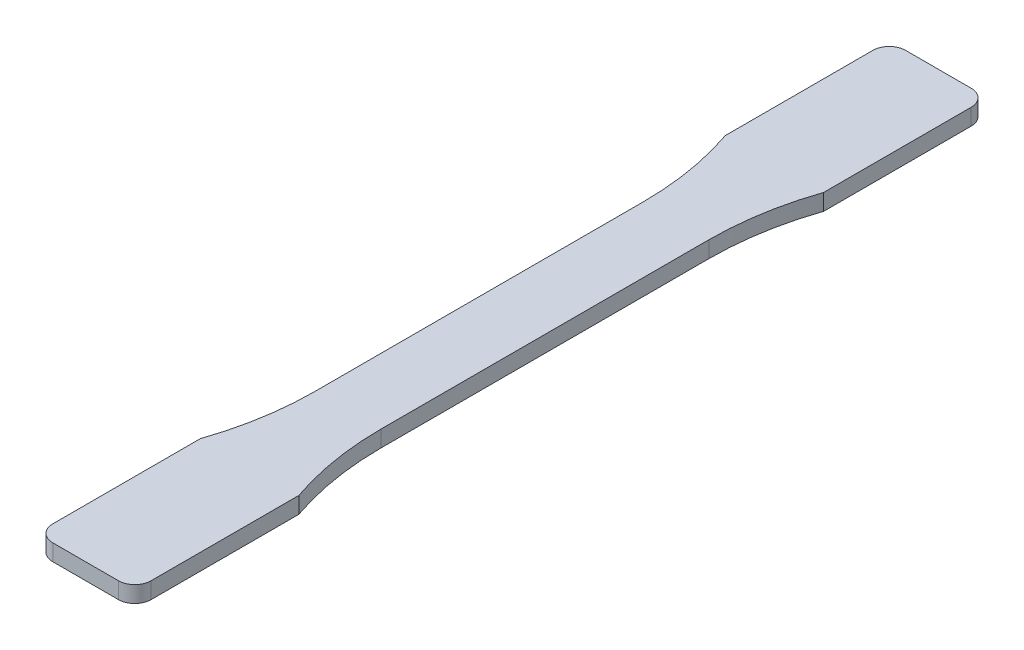
ISO-10303-21;
HEADER;
FILE_DESCRIPTION(('STEP AP214'),'2;1');
FILE_NAME('part.step','',(''),(''),'','','');
FILE_SCHEMA(('AUTOMOTIVE_DESIGN { 1 0 10303 214 1 1 1 1 }'));
ENDSEC;
DATA;
#1=APPLICATION_CONTEXT('core data for automotive mechanical design processes');
#2=APPLICATION_PROTOCOL_DEFINITION('international standard','automotive_design',2000,#1);
#3=PRODUCT_CONTEXT('',#1,'mechanical');
#4=PRODUCT('Part','Part','',(#3));
#5=PRODUCT_RELATED_PRODUCT_CATEGORY('part','',(#4));
#6=PRODUCT_DEFINITION_FORMATION('','',#4);
#7=PRODUCT_DEFINITION_CONTEXT('part definition',#1,'design');
#8=PRODUCT_DEFINITION('design','',#6,#7);
#9=PRODUCT_DEFINITION_SHAPE('','',#8);
#10=(LENGTH_UNIT() NAMED_UNIT(*) SI_UNIT(.MILLI.,.METRE.));
#11=(NAMED_UNIT(*) PLANE_ANGLE_UNIT() SI_UNIT($,.RADIAN.));
#12=(NAMED_UNIT(*) SI_UNIT($,.STERADIAN.) SOLID_ANGLE_UNIT());
#13=UNCERTAINTY_MEASURE_WITH_UNIT(LENGTH_MEASURE(1.E-05),#10,'distance_accuracy_value','');
#14=(GEOMETRIC_REPRESENTATION_CONTEXT(3) GLOBAL_UNCERTAINTY_ASSIGNED_CONTEXT((#13)) GLOBAL_UNIT_ASSIGNED_CONTEXT((#10,
#11,#12)) REPRESENTATION_CONTEXT('',''));
#15=CARTESIAN_POINT('',(0.,0.,0.));
#16=DIRECTION('',(0.,0.,1.));
#17=DIRECTION('',(1.,0.,0.));
#18=AXIS2_PLACEMENT_3D('',#15,#16,#17);
#19=CARTESIAN_POINT('',(9.525,1.5875,50.7999999999999));
#20=DIRECTION('',(-1.,0.,0.));
#21=DIRECTION('',(0.,0.,1.));
#22=AXIS2_PLACEMENT_3D('',#19,#20,#21);
#23=PLANE('',#22);
#24=DIRECTION('',(0.,0.,-1.));
#25=VECTOR('',#24,1.);
#26=CARTESIAN_POINT('',(9.525,1.5875,50.7999999999999));
#27=LINE('',#26,#25);
#28=CARTESIAN_POINT('',(9.525,1.5875,79.3749999999999));
#29=VERTEX_POINT('',#28);
#30=CARTESIAN_POINT('',(9.52499999999999,1.5875,50.7999999999999));
#31=VERTEX_POINT('',#30);
#32=EDGE_CURVE('E153',#29,#31,#27,.T.);
#33=ORIENTED_EDGE('',*,*,#32,.F.);
#34=DIRECTION('',(0.,-1.,0.));
#35=VECTOR('',#34,1.);
#36=CARTESIAN_POINT('',(9.525,1.5875,79.3749999999999));
#37=LINE('',#36,#35);
#38=CARTESIAN_POINT('',(9.525,-1.5875,79.3749999999999));
#39=VERTEX_POINT('',#38);
#40=EDGE_CURVE('E11',#29,#39,#37,.T.);
#41=ORIENTED_EDGE('',*,*,#40,.T.);
#42=DIRECTION('',(0.,0.,-1.));
#43=VECTOR('',#42,1.);
#44=CARTESIAN_POINT('',(9.525,-1.5875,50.7999999999999));
#45=LINE('',#44,#43);
#46=CARTESIAN_POINT('',(9.52499999999999,-1.5875,50.7999999999999));
#47=VERTEX_POINT('',#46);
#48=EDGE_CURVE('E178',#39,#47,#45,.T.);
#49=ORIENTED_EDGE('',*,*,#48,.T.);
#50=DIRECTION('',(0.,-1.,0.));
#51=VECTOR('',#50,1.);
#52=CARTESIAN_POINT('',(9.52499999999999,1.5875,50.7999999999999));
#53=LINE('',#52,#51);
#54=EDGE_CURVE('E170',#31,#47,#53,.T.);
#55=ORIENTED_EDGE('',*,*,#54,.F.);
#56=EDGE_LOOP('',(#33,#41,#49,#55));
#57=FACE_BOUND('',#56,.T.);
#58=ADVANCED_FACE('F39',(#57),#23,.F.);
#59=CARTESIAN_POINT('',(65.0874999999999,1.5875,31.7499999999999));
#60=DIRECTION('',(0.,-1.,0.));
#61=DIRECTION('',(0.,0.,-1.));
#62=AXIS2_PLACEMENT_3D('',#59,#60,#61);
#63=CYLINDRICAL_SURFACE('',#62,58.7374999999999);
#64=CARTESIAN_POINT('',(65.0874999999999,-1.5875,31.7499999999999));
#65=DIRECTION('',(0.,-1.,0.));
#66=DIRECTION('',(0.,0.,1.));
#67=AXIS2_PLACEMENT_3D('',#64,#65,#66);
#68=CIRCLE('',#67,58.7374999999999);
#69=CARTESIAN_POINT('',(6.34999999999999,-1.5875,31.7499999999999));
#70=VERTEX_POINT('',#69);
#71=EDGE_CURVE('E299',#47,#70,#68,.T.);
#72=ORIENTED_EDGE('',*,*,#71,.T.);
#73=DIRECTION('',(0.,-1.,0.));
#74=VECTOR('',#73,1.);
#75=CARTESIAN_POINT('',(6.34999999999999,1.5875,31.7499999999999));
#76=LINE('',#75,#74);
#77=CARTESIAN_POINT('',(6.34999999999999,1.5875,31.7499999999999));
#78=VERTEX_POINT('',#77);
#79=EDGE_CURVE('E172',#78,#70,#76,.T.);
#80=ORIENTED_EDGE('',*,*,#79,.F.);
#81=CARTESIAN_POINT('',(65.0874999999999,1.5875,31.7499999999999));
#82=DIRECTION('',(0.,-1.,0.));
#83=DIRECTION('',(0.,0.,1.));
#84=AXIS2_PLACEMENT_3D('',#81,#82,#83);
#85=CIRCLE('',#84,58.7374999999999);
#86=EDGE_CURVE('E157',#31,#78,#85,.T.);
#87=ORIENTED_EDGE('',*,*,#86,.F.);
#88=ORIENTED_EDGE('',*,*,#54,.T.);
#89=EDGE_LOOP('',(#72,#80,#87,#88));
#90=FACE_BOUND('',#89,.T.);
#91=ADVANCED_FACE('F169',(#90),#63,.F.);
#92=CARTESIAN_POINT('',(6.34999999999999,1.5875,-31.7500000000001));
#93=DIRECTION('',(-1.,0.,0.));
#94=DIRECTION('',(0.,0.,1.));
#95=AXIS2_PLACEMENT_3D('',#92,#93,#94);
#96=PLANE('',#95);
#97=DIRECTION('',(0.,0.,-1.));
#98=VECTOR('',#97,1.);
#99=CARTESIAN_POINT('',(6.34999999999999,-1.5875,-31.7500000000001));
#100=LINE('',#99,#98);
#101=CARTESIAN_POINT('',(6.34999999999999,-1.5875,-31.7500000000001));
#102=VERTEX_POINT('',#101);
#103=EDGE_CURVE('E290',#70,#102,#100,.T.);
#104=ORIENTED_EDGE('',*,*,#103,.T.);
#105=DIRECTION('',(0.,-1.,0.));
#106=VECTOR('',#105,1.);
#107=CARTESIAN_POINT('',(6.34999999999999,1.5875,-31.7500000000001));
#108=LINE('',#107,#106);
#109=CARTESIAN_POINT('',(6.34999999999999,1.5875,-31.7500000000001));
#110=VERTEX_POINT('',#109);
#111=EDGE_CURVE('E188',#110,#102,#108,.T.);
#112=ORIENTED_EDGE('',*,*,#111,.F.);
#113=DIRECTION('',(0.,0.,-1.));
#114=VECTOR('',#113,1.);
#115=CARTESIAN_POINT('',(6.34999999999999,1.5875,-31.7500000000001));
#116=LINE('',#115,#114);
#117=EDGE_CURVE('E175',#78,#110,#116,.T.);
#118=ORIENTED_EDGE('',*,*,#117,.F.);
#119=ORIENTED_EDGE('',*,*,#79,.T.);
#120=EDGE_LOOP('',(#104,#112,#118,#119));
#121=FACE_BOUND('',#120,.T.);
#122=ADVANCED_FACE('F367',(#121),#96,.F.);
#123=CARTESIAN_POINT('',(65.0875,1.5875,-31.7500000000001));
#124=DIRECTION('',(0.,-1.,0.));
#125=DIRECTION('',(0.,0.,-1.));
#126=AXIS2_PLACEMENT_3D('',#123,#124,#125);
#127=CYLINDRICAL_SURFACE('',#126,58.7375000000001);
#128=CARTESIAN_POINT('',(65.0875,-1.5875,-31.7500000000001));
#129=DIRECTION('',(0.,-1.,0.));
#130=DIRECTION('',(0.,0.,-1.));
#131=AXIS2_PLACEMENT_3D('',#128,#129,#130);
#132=CIRCLE('',#131,58.7375000000001);
#133=CARTESIAN_POINT('',(9.52499999999998,-1.5875,-50.8000000000001));
#134=VERTEX_POINT('',#133);
#135=EDGE_CURVE('E285',#102,#134,#132,.T.);
#136=ORIENTED_EDGE('',*,*,#135,.T.);
#137=DIRECTION('',(0.,-1.,0.));
#138=VECTOR('',#137,1.);
#139=CARTESIAN_POINT('',(9.52499999999998,1.5875,-50.8000000000001));
#140=LINE('',#139,#138);
#141=CARTESIAN_POINT('',(9.52499999999998,1.5875,-50.8000000000001));
#142=VERTEX_POINT('',#141);
#143=EDGE_CURVE('E274',#142,#134,#140,.T.);
#144=ORIENTED_EDGE('',*,*,#143,.F.);
#145=CARTESIAN_POINT('',(65.0875,1.5875,-31.7500000000001));
#146=DIRECTION('',(0.,-1.,0.));
#147=DIRECTION('',(0.,0.,-1.));
#148=AXIS2_PLACEMENT_3D('',#145,#146,#147);
#149=CIRCLE('',#148,58.7375000000001);
#150=EDGE_CURVE('E286',#110,#142,#149,.T.);
#151=ORIENTED_EDGE('',*,*,#150,.F.);
#152=ORIENTED_EDGE('',*,*,#111,.T.);
#153=EDGE_LOOP('',(#136,#144,#151,#152));
#154=FACE_BOUND('',#153,.T.);
#155=ADVANCED_FACE('F283',(#154),#127,.F.);
#156=CARTESIAN_POINT('',(9.52499999999998,1.5875,-82.5500000000001));
#157=DIRECTION('',(-1.,0.,0.));
#158=DIRECTION('',(0.,0.,1.));
#159=AXIS2_PLACEMENT_3D('',#156,#157,#158);
#160=PLANE('',#159);
#161=DIRECTION('',(0.,0.,-1.));
#162=VECTOR('',#161,1.);
#163=CARTESIAN_POINT('',(9.52499999999998,-1.5875,-82.5500000000001));
#164=LINE('',#163,#162);
#165=CARTESIAN_POINT('',(9.52499999999998,-1.5875,-79.3750000000001));
#166=VERTEX_POINT('',#165);
#167=EDGE_CURVE('E292',#134,#166,#164,.T.);
#168=ORIENTED_EDGE('',*,*,#167,.T.);
#169=DIRECTION('',(0.,-1.,0.));
#170=VECTOR('',#169,1.);
#171=CARTESIAN_POINT('',(9.52499999999998,1.5875,-79.3750000000001));
#172=LINE('',#171,#170);
#173=CARTESIAN_POINT('',(9.52499999999998,1.5875,-79.3750000000001));
#174=VERTEX_POINT('',#173);
#175=EDGE_CURVE('E220',#166,#174,#172,.F.);
#176=ORIENTED_EDGE('',*,*,#175,.T.);
#177=DIRECTION('',(0.,0.,-1.));
#178=VECTOR('',#177,1.);
#179=CARTESIAN_POINT('',(9.52499999999998,1.5875,-82.5500000000001));
#180=LINE('',#179,#178);
#181=EDGE_CURVE('E349',#142,#174,#180,.T.);
#182=ORIENTED_EDGE('',*,*,#181,.F.);
#183=ORIENTED_EDGE('',*,*,#143,.T.);
#184=EDGE_LOOP('',(#168,#176,#182,#183));
#185=FACE_BOUND('',#184,.T.);
#186=ADVANCED_FACE('F373',(#185),#160,.F.);
#187=CARTESIAN_POINT('',(-9.52500000000002,1.5875,-82.5500000000001));
#188=DIRECTION('',(0.,0.,1.));
#189=DIRECTION('',(1.,0.,0.));
#190=AXIS2_PLACEMENT_3D('',#187,#188,#189);
#191=PLANE('',#190);
#192=DIRECTION('',(-1.,0.,0.));
#193=VECTOR('',#192,1.);
#194=CARTESIAN_POINT('',(-9.52500000000002,-1.5875,-82.5500000000001));
#195=LINE('',#194,#193);
#196=CARTESIAN_POINT('',(6.34999999999998,-1.5875,-82.5500000000001));
#197=VERTEX_POINT('',#196);
#198=CARTESIAN_POINT('',(-6.35000000000002,-1.5875,-82.5500000000001));
#199=VERTEX_POINT('',#198);
#200=EDGE_CURVE('E297',#197,#199,#195,.T.);
#201=ORIENTED_EDGE('',*,*,#200,.T.);
#202=DIRECTION('',(0.,-1.,0.));
#203=VECTOR('',#202,1.);
#204=CARTESIAN_POINT('',(-6.35000000000002,1.5875,-82.5500000000001));
#205=LINE('',#204,#203);
#206=CARTESIAN_POINT('',(-6.35000000000002,1.5875,-82.5500000000001));
#207=VERTEX_POINT('',#206);
#208=EDGE_CURVE('E207',#199,#207,#205,.F.);
#209=ORIENTED_EDGE('',*,*,#208,.T.);
#210=DIRECTION('',(-1.,0.,0.));
#211=VECTOR('',#210,1.);
#212=CARTESIAN_POINT('',(-9.52500000000002,1.5875,-82.5500000000001));
#213=LINE('',#212,#211);
#214=CARTESIAN_POINT('',(6.34999999999998,1.5875,-82.5500000000001));
#215=VERTEX_POINT('',#214);
#216=EDGE_CURVE('E345',#215,#207,#213,.T.);
#217=ORIENTED_EDGE('',*,*,#216,.F.);
#218=DIRECTION('',(0.,-1.,0.));
#219=VECTOR('',#218,1.);
#220=CARTESIAN_POINT('',(6.34999999999998,1.5875,-82.5500000000001));
#221=LINE('',#220,#219);
#222=EDGE_CURVE('E203',#215,#197,#221,.T.);
#223=ORIENTED_EDGE('',*,*,#222,.T.);
#224=EDGE_LOOP('',(#201,#209,#217,#223));
#225=FACE_BOUND('',#224,.T.);
#226=ADVANCED_FACE('F340',(#225),#191,.F.);
#227=CARTESIAN_POINT('',(-9.52500000000002,1.5875,-82.5500000000001));
#228=DIRECTION('',(1.,0.,0.));
#229=DIRECTION('',(0.,0.,-1.));
#230=AXIS2_PLACEMENT_3D('',#227,#228,#229);
#231=PLANE('',#230);
#232=DIRECTION('',(0.,0.,1.));
#233=VECTOR('',#232,1.);
#234=CARTESIAN_POINT('',(-9.52500000000002,1.5875,-82.5500000000001));
#235=LINE('',#234,#233);
#236=CARTESIAN_POINT('',(-9.52500000000002,1.5875,-79.3750000000001));
#237=VERTEX_POINT('',#236);
#238=CARTESIAN_POINT('',(-9.52500000000002,1.5875,-50.8000000000001));
#239=VERTEX_POINT('',#238);
#240=EDGE_CURVE('E334',#237,#239,#235,.T.);
#241=ORIENTED_EDGE('',*,*,#240,.F.);
#242=DIRECTION('',(0.,-1.,0.));
#243=VECTOR('',#242,1.);
#244=CARTESIAN_POINT('',(-9.52500000000002,1.5875,-79.3750000000001));
#245=LINE('',#244,#243);
#246=CARTESIAN_POINT('',(-9.52500000000002,-1.5875,-79.3750000000001));
#247=VERTEX_POINT('',#246);
#248=EDGE_CURVE('E181',#237,#247,#245,.T.);
#249=ORIENTED_EDGE('',*,*,#248,.T.);
#250=DIRECTION('',(0.,0.,1.));
#251=VECTOR('',#250,1.);
#252=CARTESIAN_POINT('',(-9.52500000000002,-1.5875,-82.5500000000001));
#253=LINE('',#252,#251);
#254=CARTESIAN_POINT('',(-9.52500000000002,-1.5875,-50.8000000000001));
#255=VERTEX_POINT('',#254);
#256=EDGE_CURVE('E306',#247,#255,#253,.T.);
#257=ORIENTED_EDGE('',*,*,#256,.T.);
#258=DIRECTION('',(0.,-1.,0.));
#259=VECTOR('',#258,1.);
#260=CARTESIAN_POINT('',(-9.52500000000002,1.5875,-50.8000000000001));
#261=LINE('',#260,#259);
#262=EDGE_CURVE('E270',#239,#255,#261,.T.);
#263=ORIENTED_EDGE('',*,*,#262,.F.);
#264=EDGE_LOOP('',(#241,#249,#257,#263));
#265=FACE_BOUND('',#264,.T.);
#266=ADVANCED_FACE('F333',(#265),#231,.F.);
#267=CARTESIAN_POINT('',(-65.0874999999999,1.5875,-31.7500000000001));
#268=DIRECTION('',(0.,-1.,0.));
#269=DIRECTION('',(0.,0.,-1.));
#270=AXIS2_PLACEMENT_3D('',#267,#268,#269);
#271=CYLINDRICAL_SURFACE('',#270,58.7374999999999);
#272=CARTESIAN_POINT('',(-65.0874999999999,-1.5875,-31.7500000000001));
#273=DIRECTION('',(0.,-1.,0.));
#274=DIRECTION('',(0.,0.,1.));
#275=AXIS2_PLACEMENT_3D('',#272,#273,#274);
#276=CIRCLE('',#275,58.7374999999999);
#277=CARTESIAN_POINT('',(-6.35000000000001,-1.5875,-31.7500000000001));
#278=VERTEX_POINT('',#277);
#279=EDGE_CURVE('E309',#255,#278,#276,.T.);
#280=ORIENTED_EDGE('',*,*,#279,.T.);
#281=DIRECTION('',(0.,-1.,0.));
#282=VECTOR('',#281,1.);
#283=CARTESIAN_POINT('',(-6.35000000000001,1.5875,-31.7500000000001));
#284=LINE('',#283,#282);
#285=CARTESIAN_POINT('',(-6.35000000000001,1.5875,-31.7500000000001));
#286=VERTEX_POINT('',#285);
#287=EDGE_CURVE('E266',#286,#278,#284,.T.);
#288=ORIENTED_EDGE('',*,*,#287,.F.);
#289=CARTESIAN_POINT('',(-65.0874999999999,1.5875,-31.7500000000001));
#290=DIRECTION('',(0.,-1.,0.));
#291=DIRECTION('',(0.,0.,1.));
#292=AXIS2_PLACEMENT_3D('',#289,#290,#291);
#293=CIRCLE('',#292,58.7374999999999);
#294=EDGE_CURVE('E329',#239,#286,#293,.T.);
#295=ORIENTED_EDGE('',*,*,#294,.F.);
#296=ORIENTED_EDGE('',*,*,#262,.T.);
#297=EDGE_LOOP('',(#280,#288,#295,#296));
#298=FACE_BOUND('',#297,.T.);
#299=ADVANCED_FACE('F328',(#298),#271,.F.);
#300=CARTESIAN_POINT('',(-6.35000000000001,1.5875,-31.7500000000001));
#301=DIRECTION('',(1.,0.,0.));
#302=DIRECTION('',(0.,0.,-1.));
#303=AXIS2_PLACEMENT_3D('',#300,#301,#302);
#304=PLANE('',#303);
#305=DIRECTION('',(0.,0.,1.));
#306=VECTOR('',#305,1.);
#307=CARTESIAN_POINT('',(-6.35000000000001,-1.5875,-31.7500000000001));
#308=LINE('',#307,#306);
#309=CARTESIAN_POINT('',(-6.35000000000001,-1.5875,31.7499999999999));
#310=VERTEX_POINT('',#309);
#311=EDGE_CURVE('E312',#278,#310,#308,.T.);
#312=ORIENTED_EDGE('',*,*,#311,.T.);
#313=DIRECTION('',(0.,-1.,0.));
#314=VECTOR('',#313,1.);
#315=CARTESIAN_POINT('',(-6.35000000000001,1.5875,31.7499999999999));
#316=LINE('',#315,#314);
#317=CARTESIAN_POINT('',(-6.35000000000001,1.5875,31.7499999999999));
#318=VERTEX_POINT('',#317);
#319=EDGE_CURVE('E262',#318,#310,#316,.T.);
#320=ORIENTED_EDGE('',*,*,#319,.F.);
#321=DIRECTION('',(0.,0.,1.));
#322=VECTOR('',#321,1.);
#323=CARTESIAN_POINT('',(-6.35000000000001,1.5875,-31.7500000000001));
#324=LINE('',#323,#322);
#325=EDGE_CURVE('E325',#286,#318,#324,.T.);
#326=ORIENTED_EDGE('',*,*,#325,.F.);
#327=ORIENTED_EDGE('',*,*,#287,.T.);
#328=EDGE_LOOP('',(#312,#320,#326,#327));
#329=FACE_BOUND('',#328,.T.);
#330=ADVANCED_FACE('F322',(#329),#304,.F.);
#331=CARTESIAN_POINT('',(-65.0875000000001,1.5875,31.7499999999999));
#332=DIRECTION('',(0.,-1.,0.));
#333=DIRECTION('',(0.,0.,-1.));
#334=AXIS2_PLACEMENT_3D('',#331,#332,#333);
#335=CYLINDRICAL_SURFACE('',#334,58.7375000000001);
#336=CARTESIAN_POINT('',(-65.0875000000001,-1.5875,31.7499999999999));
#337=DIRECTION('',(0.,-1.,0.));
#338=DIRECTION('',(0.,0.,-1.));
#339=AXIS2_PLACEMENT_3D('',#336,#337,#338);
#340=CIRCLE('',#339,58.7375000000001);
#341=CARTESIAN_POINT('',(-9.525,-1.5875,50.7999999999999));
#342=VERTEX_POINT('',#341);
#343=EDGE_CURVE('E255',#310,#342,#340,.T.);
#344=ORIENTED_EDGE('',*,*,#343,.T.);
#345=DIRECTION('',(0.,-1.,0.));
#346=VECTOR('',#345,1.);
#347=CARTESIAN_POINT('',(-9.525,1.5875,50.7999999999999));
#348=LINE('',#347,#346);
#349=CARTESIAN_POINT('',(-9.525,1.5875,50.7999999999999));
#350=VERTEX_POINT('',#349);
#351=EDGE_CURVE('E259',#350,#342,#348,.T.);
#352=ORIENTED_EDGE('',*,*,#351,.F.);
#353=CARTESIAN_POINT('',(-65.0875000000001,1.5875,31.7499999999999));
#354=DIRECTION('',(0.,-1.,0.));
#355=DIRECTION('',(0.,0.,-1.));
#356=AXIS2_PLACEMENT_3D('',#353,#354,#355);
#357=CIRCLE('',#356,58.7375000000001);
#358=EDGE_CURVE('E240',#318,#350,#357,.T.);
#359=ORIENTED_EDGE('',*,*,#358,.F.);
#360=ORIENTED_EDGE('',*,*,#319,.T.);
#361=EDGE_LOOP('',(#344,#352,#359,#360));
#362=FACE_BOUND('',#361,.T.);
#363=ADVANCED_FACE('F317',(#362),#335,.F.);
#364=CARTESIAN_POINT('',(-9.525,1.5875,50.7999999999999));
#365=DIRECTION('',(1.,0.,0.));
#366=DIRECTION('',(0.,0.,-1.));
#367=AXIS2_PLACEMENT_3D('',#364,#365,#366);
#368=PLANE('',#367);
#369=DIRECTION('',(0.,0.,1.));
#370=VECTOR('',#369,1.);
#371=CARTESIAN_POINT('',(-9.525,-1.5875,50.7999999999999));
#372=LINE('',#371,#370);
#373=CARTESIAN_POINT('',(-9.525,-1.5875,79.3749999999999));
#374=VERTEX_POINT('',#373);
#375=EDGE_CURVE('E237',#342,#374,#372,.T.);
#376=ORIENTED_EDGE('',*,*,#375,.T.);
#377=DIRECTION('',(0.,-1.,0.));
#378=VECTOR('',#377,1.);
#379=CARTESIAN_POINT('',(-9.525,1.5875,79.3749999999999));
#380=LINE('',#379,#378);
#381=CARTESIAN_POINT('',(-9.525,1.5875,79.3749999999999));
#382=VERTEX_POINT('',#381);
#383=EDGE_CURVE('E48',#374,#382,#380,.F.);
#384=ORIENTED_EDGE('',*,*,#383,.T.);
#385=DIRECTION('',(0.,0.,1.));
#386=VECTOR('',#385,1.);
#387=CARTESIAN_POINT('',(-9.525,1.5875,50.7999999999999));
#388=LINE('',#387,#386);
#389=EDGE_CURVE('E235',#350,#382,#388,.T.);
#390=ORIENTED_EDGE('',*,*,#389,.F.);
#391=ORIENTED_EDGE('',*,*,#351,.T.);
#392=EDGE_LOOP('',(#376,#384,#390,#391));
#393=FACE_BOUND('',#392,.T.);
#394=ADVANCED_FACE('F233',(#393),#368,.F.);
#395=CARTESIAN_POINT('',(-9.525,1.5875,82.5499999999999));
#396=DIRECTION('',(0.,0.,-1.));
#397=DIRECTION('',(-1.,0.,0.));
#398=AXIS2_PLACEMENT_3D('',#395,#396,#397);
#399=PLANE('',#398);
#400=DIRECTION('',(1.,0.,0.));
#401=VECTOR('',#400,1.);
#402=CARTESIAN_POINT('',(-9.525,1.5875,82.5499999999999));
#403=LINE('',#402,#401);
#404=CARTESIAN_POINT('',(-6.35,1.5875,82.5499999999999));
#405=VERTEX_POINT('',#404);
#406=CARTESIAN_POINT('',(6.34999999999999,1.5875,82.5499999999999));
#407=VERTEX_POINT('',#406);
#408=EDGE_CURVE('E243',#405,#407,#403,.T.);
#409=ORIENTED_EDGE('',*,*,#408,.F.);
#410=DIRECTION('',(0.,-1.,0.));
#411=VECTOR('',#410,1.);
#412=CARTESIAN_POINT('',(-6.35,1.5875,82.5499999999999));
#413=LINE('',#412,#411);
#414=CARTESIAN_POINT('',(-6.35,-1.5875,82.5499999999999));
#415=VERTEX_POINT('',#414);
#416=EDGE_CURVE('E225',#405,#415,#413,.T.);
#417=ORIENTED_EDGE('',*,*,#416,.T.);
#418=DIRECTION('',(1.,0.,0.));
#419=VECTOR('',#418,1.);
#420=CARTESIAN_POINT('',(-9.525,-1.5875,82.5499999999999));
#421=LINE('',#420,#419);
#422=CARTESIAN_POINT('',(6.34999999999999,-1.5875,82.5499999999999));
#423=VERTEX_POINT('',#422);
#424=EDGE_CURVE('E165',#415,#423,#421,.T.);
#425=ORIENTED_EDGE('',*,*,#424,.T.);
#426=DIRECTION('',(0.,-1.,0.));
#427=VECTOR('',#426,1.);
#428=CARTESIAN_POINT('',(6.35,1.5875,82.5499999999999));
#429=LINE('',#428,#427);
#430=EDGE_CURVE('E55',#423,#407,#429,.F.);
#431=ORIENTED_EDGE('',*,*,#430,.T.);
#432=EDGE_LOOP('',(#409,#417,#425,#431));
#433=FACE_BOUND('',#432,.T.);
#434=ADVANCED_FACE('F248',(#433),#399,.F.);
#435=CARTESIAN_POINT('',(-65.0875000000001,1.5875,31.7499999999999));
#436=DIRECTION('',(0.,-1.,0.));
#437=DIRECTION('',(0.,0.,-1.));
#438=AXIS2_PLACEMENT_3D('',#435,#436,#437);
#439=PLANE('',#438);
#440=ORIENTED_EDGE('',*,*,#216,.T.);
#441=CARTESIAN_POINT('',(-6.35000000000002,1.5875,-79.3750000000001));
#442=DIRECTION('',(0.,-1.,0.));
#443=DIRECTION('',(0.,0.,-1.));
#444=AXIS2_PLACEMENT_3D('',#441,#442,#443);
#445=CIRCLE('',#444,3.175);
#446=EDGE_CURVE('E217',#207,#237,#445,.F.);
#447=ORIENTED_EDGE('',*,*,#446,.T.);
#448=ORIENTED_EDGE('',*,*,#240,.T.);
#449=ORIENTED_EDGE('',*,*,#294,.T.);
#450=ORIENTED_EDGE('',*,*,#325,.T.);
#451=ORIENTED_EDGE('',*,*,#358,.T.);
#452=ORIENTED_EDGE('',*,*,#389,.T.);
#453=CARTESIAN_POINT('',(-6.35,1.5875,79.3749999999999));
#454=DIRECTION('',(0.,-1.,0.));
#455=DIRECTION('',(0.,0.,-1.));
#456=AXIS2_PLACEMENT_3D('',#453,#454,#455);
#457=CIRCLE('',#456,3.175);
#458=EDGE_CURVE('E62',#382,#405,#457,.F.);
#459=ORIENTED_EDGE('',*,*,#458,.T.);
#460=ORIENTED_EDGE('',*,*,#408,.T.);
#461=CARTESIAN_POINT('',(6.35,1.5875,79.3749999999999));
#462=DIRECTION('',(0.,-1.,0.));
#463=DIRECTION('',(0.,0.,-1.));
#464=AXIS2_PLACEMENT_3D('',#461,#462,#463);
#465=CIRCLE('',#464,3.175);
#466=EDGE_CURVE('E160',#407,#29,#465,.F.);
#467=ORIENTED_EDGE('',*,*,#466,.T.);
#468=ORIENTED_EDGE('',*,*,#32,.T.);
#469=ORIENTED_EDGE('',*,*,#86,.T.);
#470=ORIENTED_EDGE('',*,*,#117,.T.);
#471=ORIENTED_EDGE('',*,*,#150,.T.);
#472=ORIENTED_EDGE('',*,*,#181,.T.);
#473=CARTESIAN_POINT('',(6.34999999999998,1.5875,-79.3750000000001));
#474=DIRECTION('',(0.,-1.,0.));
#475=DIRECTION('',(0.,0.,-1.));
#476=AXIS2_PLACEMENT_3D('',#473,#474,#475);
#477=CIRCLE('',#476,3.175);
#478=EDGE_CURVE('E214',#174,#215,#477,.F.);
#479=ORIENTED_EDGE('',*,*,#478,.T.);
#480=EDGE_LOOP('',(#440,#447,#448,#449,#450,#451,#452,#459,#460,#467,#468,#469,#470,#471,#472,#479));
#481=FACE_BOUND('',#480,.T.);
#482=ADVANCED_FACE('F156',(#481),#439,.F.);
#483=CARTESIAN_POINT('',(-65.0875000000001,-1.5875,31.7499999999999));
#484=DIRECTION('',(0.,-1.,0.));
#485=DIRECTION('',(0.,0.,-1.));
#486=AXIS2_PLACEMENT_3D('',#483,#484,#485);
#487=PLANE('',#486);
#488=ORIENTED_EDGE('',*,*,#256,.F.);
#489=CARTESIAN_POINT('',(-6.35000000000002,-1.5875,-79.3750000000001));
#490=DIRECTION('',(0.,-1.,0.));
#491=DIRECTION('',(0.,0.,-1.));
#492=AXIS2_PLACEMENT_3D('',#489,#490,#491);
#493=CIRCLE('',#492,3.175);
#494=EDGE_CURVE('E200',#247,#199,#493,.T.);
#495=ORIENTED_EDGE('',*,*,#494,.T.);
#496=ORIENTED_EDGE('',*,*,#200,.F.);
#497=CARTESIAN_POINT('',(6.34999999999998,-1.5875,-79.3750000000001));
#498=DIRECTION('',(0.,-1.,0.));
#499=DIRECTION('',(0.,0.,-1.));
#500=AXIS2_PLACEMENT_3D('',#497,#498,#499);
#501=CIRCLE('',#500,3.175);
#502=EDGE_CURVE('E197',#197,#166,#501,.T.);
#503=ORIENTED_EDGE('',*,*,#502,.T.);
#504=ORIENTED_EDGE('',*,*,#167,.F.);
#505=ORIENTED_EDGE('',*,*,#135,.F.);
#506=ORIENTED_EDGE('',*,*,#103,.F.);
#507=ORIENTED_EDGE('',*,*,#71,.F.);
#508=ORIENTED_EDGE('',*,*,#48,.F.);
#509=CARTESIAN_POINT('',(6.35,-1.5875,79.3749999999999));
#510=DIRECTION('',(0.,-1.,0.));
#511=DIRECTION('',(0.,0.,-1.));
#512=AXIS2_PLACEMENT_3D('',#509,#510,#511);
#513=CIRCLE('',#512,3.175);
#514=EDGE_CURVE('E186',#39,#423,#513,.T.);
#515=ORIENTED_EDGE('',*,*,#514,.T.);
#516=ORIENTED_EDGE('',*,*,#424,.F.);
#517=CARTESIAN_POINT('',(-6.35,-1.5875,79.3749999999999));
#518=DIRECTION('',(0.,-1.,0.));
#519=DIRECTION('',(0.,0.,-1.));
#520=AXIS2_PLACEMENT_3D('',#517,#518,#519);
#521=CIRCLE('',#520,3.175);
#522=EDGE_CURVE('E194',#415,#374,#521,.T.);
#523=ORIENTED_EDGE('',*,*,#522,.T.);
#524=ORIENTED_EDGE('',*,*,#375,.F.);
#525=ORIENTED_EDGE('',*,*,#343,.F.);
#526=ORIENTED_EDGE('',*,*,#311,.F.);
#527=ORIENTED_EDGE('',*,*,#279,.F.);
#528=EDGE_LOOP('',(#488,#495,#496,#503,#504,#505,#506,#507,#508,#515,#516,#523,#524,#525,#526,#527));
#529=FACE_BOUND('',#528,.T.);
#530=ADVANCED_FACE('F251',(#529),#487,.T.);
#531=CARTESIAN_POINT('',(-6.35000000000002,1.5875,-79.3750000000001));
#532=DIRECTION('',(0.,-1.,0.));
#533=DIRECTION('',(0.,0.,-1.));
#534=AXIS2_PLACEMENT_3D('',#531,#532,#533);
#535=CYLINDRICAL_SURFACE('',#534,3.175);
#536=ORIENTED_EDGE('',*,*,#446,.F.);
#537=ORIENTED_EDGE('',*,*,#208,.F.);
#538=ORIENTED_EDGE('',*,*,#494,.F.);
#539=ORIENTED_EDGE('',*,*,#248,.F.);
#540=EDGE_LOOP('',(#536,#537,#538,#539));
#541=FACE_BOUND('',#540,.T.);
#542=ADVANCED_FACE('F344',(#541),#535,.T.);
#543=CARTESIAN_POINT('',(6.34999999999998,1.5875,-79.3750000000001));
#544=DIRECTION('',(0.,-1.,0.));
#545=DIRECTION('',(0.,0.,-1.));
#546=AXIS2_PLACEMENT_3D('',#543,#544,#545);
#547=CYLINDRICAL_SURFACE('',#546,3.175);
#548=ORIENTED_EDGE('',*,*,#478,.F.);
#549=ORIENTED_EDGE('',*,*,#175,.F.);
#550=ORIENTED_EDGE('',*,*,#502,.F.);
#551=ORIENTED_EDGE('',*,*,#222,.F.);
#552=EDGE_LOOP('',(#548,#549,#550,#551));
#553=FACE_BOUND('',#552,.T.);
#554=ADVANCED_FACE('F376',(#553),#547,.T.);
#555=CARTESIAN_POINT('',(-6.35,1.5875,79.3749999999999));
#556=DIRECTION('',(0.,-1.,0.));
#557=DIRECTION('',(0.,0.,-1.));
#558=AXIS2_PLACEMENT_3D('',#555,#556,#557);
#559=CYLINDRICAL_SURFACE('',#558,3.175);
#560=ORIENTED_EDGE('',*,*,#458,.F.);
#561=ORIENTED_EDGE('',*,*,#383,.F.);
#562=ORIENTED_EDGE('',*,*,#522,.F.);
#563=ORIENTED_EDGE('',*,*,#416,.F.);
#564=EDGE_LOOP('',(#560,#561,#562,#563));
#565=FACE_BOUND('',#564,.T.);
#566=ADVANCED_FACE('F246',(#565),#559,.T.);
#567=CARTESIAN_POINT('',(6.35,1.5875,79.3749999999999));
#568=DIRECTION('',(0.,-1.,0.));
#569=DIRECTION('',(0.,0.,-1.));
#570=AXIS2_PLACEMENT_3D('',#567,#568,#569);
#571=CYLINDRICAL_SURFACE('',#570,3.175);
#572=ORIENTED_EDGE('',*,*,#466,.F.);
#573=ORIENTED_EDGE('',*,*,#430,.F.);
#574=ORIENTED_EDGE('',*,*,#514,.F.);
#575=ORIENTED_EDGE('',*,*,#40,.F.);
#576=EDGE_LOOP('',(#572,#573,#574,#575));
#577=FACE_BOUND('',#576,.T.);
#578=ADVANCED_FACE('F41',(#577),#571,.T.);
#579=CLOSED_SHELL('',(#58,#91,#122,#155,#186,#226,#266,#299,#330,#363,#394,#434,#482,#530,#542,
#554,#566,#578));
#580=MANIFOLD_SOLID_BREP('B2',#579);
#581=ADVANCED_BREP_SHAPE_REPRESENTATION('',(#18,#580),#14);
#582=SHAPE_DEFINITION_REPRESENTATION(#9,#581);
ENDSEC;
END-ISO-10303-21;
